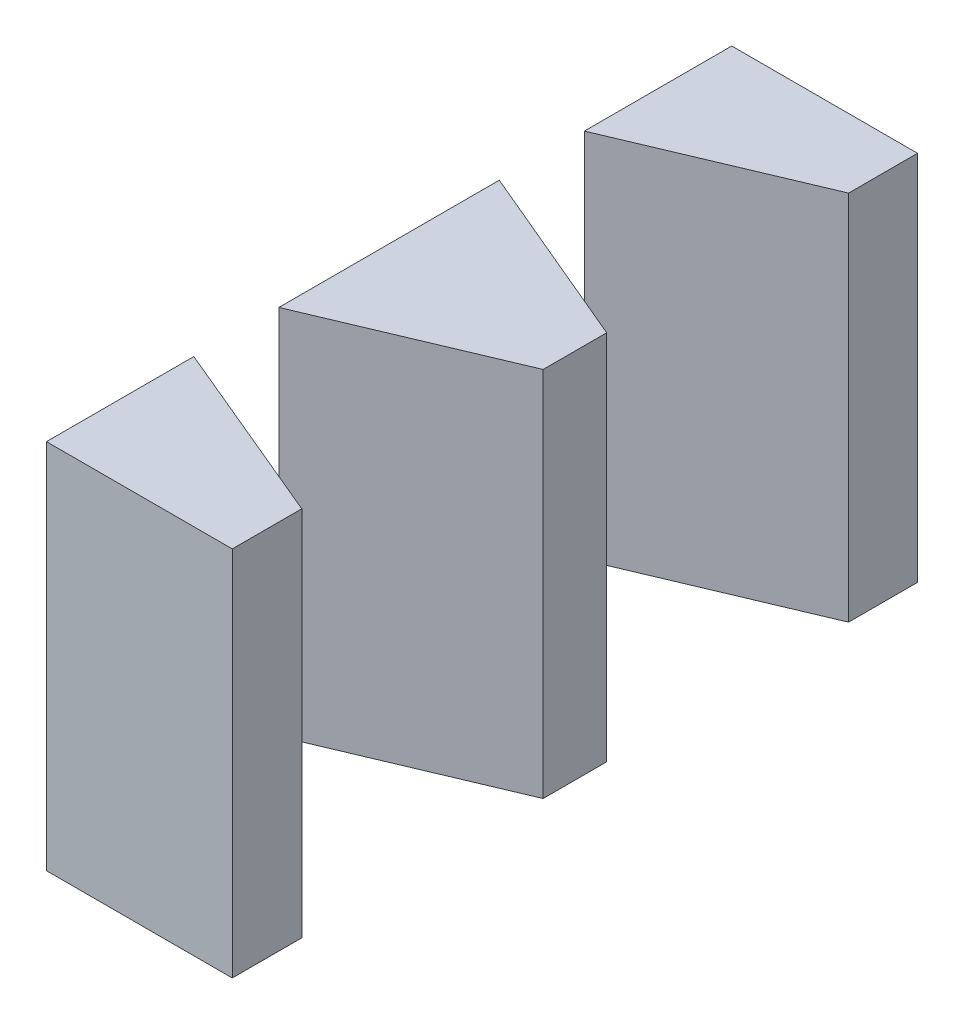
ISO-10303-21;
HEADER;
FILE_DESCRIPTION(('STEP AP214'),'2;1');
FILE_NAME('part.step','',(''),(''),'','','');
FILE_SCHEMA(('AUTOMOTIVE_DESIGN { 1 0 10303 214 1 1 1 1 }'));
ENDSEC;
DATA;
#1=APPLICATION_CONTEXT('core data for automotive mechanical design processes');
#2=APPLICATION_PROTOCOL_DEFINITION('international standard','automotive_design',2000,#1);
#3=PRODUCT_CONTEXT('',#1,'mechanical');
#4=PRODUCT('Part','Part','',(#3));
#5=PRODUCT_RELATED_PRODUCT_CATEGORY('part','',(#4));
#6=PRODUCT_DEFINITION_FORMATION('','',#4);
#7=PRODUCT_DEFINITION_CONTEXT('part definition',#1,'design');
#8=PRODUCT_DEFINITION('design','',#6,#7);
#9=PRODUCT_DEFINITION_SHAPE('','',#8);
#10=(LENGTH_UNIT() NAMED_UNIT(*) SI_UNIT(.MILLI.,.METRE.));
#11=(NAMED_UNIT(*) PLANE_ANGLE_UNIT() SI_UNIT($,.RADIAN.));
#12=(NAMED_UNIT(*) SI_UNIT($,.STERADIAN.) SOLID_ANGLE_UNIT());
#13=UNCERTAINTY_MEASURE_WITH_UNIT(LENGTH_MEASURE(1.E-05),#10,'distance_accuracy_value','');
#14=(GEOMETRIC_REPRESENTATION_CONTEXT(3) GLOBAL_UNCERTAINTY_ASSIGNED_CONTEXT((#13)) GLOBAL_UNIT_ASSIGNED_CONTEXT((#10,
#11,#12)) REPRESENTATION_CONTEXT('',''));
#15=CARTESIAN_POINT('',(0.,0.,0.));
#16=DIRECTION('',(0.,0.,1.));
#17=DIRECTION('',(1.,0.,0.));
#18=AXIS2_PLACEMENT_3D('',#15,#16,#17);
#19=CARTESIAN_POINT('',(0.,25.,0.));
#20=DIRECTION('',(1.,0.,0.));
#21=DIRECTION('',(0.,0.,-1.));
#22=AXIS2_PLACEMENT_3D('',#19,#20,#21);
#23=PLANE('',#22);
#24=DIRECTION('',(0.,-1.,0.));
#25=VECTOR('',#24,1.);
#26=CARTESIAN_POINT('',(0.,25.,-5.94815032326452));
#27=LINE('',#26,#25);
#28=CARTESIAN_POINT('',(0.,25.,-5.94815032326452));
#29=VERTEX_POINT('',#28);
#30=CARTESIAN_POINT('',(0.,10.,-5.94815032326452));
#31=VERTEX_POINT('',#30);
#32=EDGE_CURVE('E134',#29,#31,#27,.T.);
#33=ORIENTED_EDGE('',*,*,#32,.T.);
#34=DIRECTION('',(0.,0.,-1.));
#35=VECTOR('',#34,1.);
#36=CARTESIAN_POINT('',(0.,10.,0.));
#37=LINE('',#36,#35);
#38=CARTESIAN_POINT('',(0.,10.,0.));
#39=VERTEX_POINT('',#38);
#40=EDGE_CURVE('E170',#39,#31,#37,.T.);
#41=ORIENTED_EDGE('',*,*,#40,.F.);
#42=DIRECTION('',(0.,-1.,0.));
#43=VECTOR('',#42,1.);
#44=CARTESIAN_POINT('',(0.,25.,0.));
#45=LINE('',#44,#43);
#46=CARTESIAN_POINT('',(0.,25.,0.));
#47=VERTEX_POINT('',#46);
#48=EDGE_CURVE('E177',#47,#39,#45,.T.);
#49=ORIENTED_EDGE('',*,*,#48,.F.);
#50=DIRECTION('',(0.,0.,1.));
#51=VECTOR('',#50,1.);
#52=CARTESIAN_POINT('',(0.,25.,0.));
#53=LINE('',#52,#51);
#54=EDGE_CURVE('E157',#29,#47,#53,.T.);
#55=ORIENTED_EDGE('',*,*,#54,.F.);
#56=EDGE_LOOP('',(#33,#41,#49,#55));
#57=FACE_BOUND('',#56,.T.);
#58=ADVANCED_FACE('F108',(#57),#23,.F.);
#59=CARTESIAN_POINT('',(7.5,25.,0.));
#60=DIRECTION('',(-1.,0.,0.));
#61=DIRECTION('',(0.,0.,1.));
#62=AXIS2_PLACEMENT_3D('',#59,#60,#61);
#63=PLANE('',#62);
#64=DIRECTION('',(0.,-1.,0.));
#65=VECTOR('',#64,1.);
#66=CARTESIAN_POINT('',(7.5,25.,-2.80535000193112));
#67=LINE('',#66,#65);
#68=CARTESIAN_POINT('',(7.5,25.,-2.80535000193112));
#69=VERTEX_POINT('',#68);
#70=CARTESIAN_POINT('',(7.5,10.,-2.80535000193112));
#71=VERTEX_POINT('',#70);
#72=EDGE_CURVE('E13',#69,#71,#67,.T.);
#73=ORIENTED_EDGE('',*,*,#72,.F.);
#74=DIRECTION('',(0.,0.,-1.));
#75=VECTOR('',#74,1.);
#76=CARTESIAN_POINT('',(7.5,25.,0.));
#77=LINE('',#76,#75);
#78=CARTESIAN_POINT('',(7.5,25.,0.));
#79=VERTEX_POINT('',#78);
#80=EDGE_CURVE('E111',#79,#69,#77,.T.);
#81=ORIENTED_EDGE('',*,*,#80,.F.);
#82=DIRECTION('',(0.,-1.,0.));
#83=VECTOR('',#82,1.);
#84=CARTESIAN_POINT('',(7.5,25.,0.));
#85=LINE('',#84,#83);
#86=CARTESIAN_POINT('',(7.5,10.,0.));
#87=VERTEX_POINT('',#86);
#88=EDGE_CURVE('E163',#79,#87,#85,.T.);
#89=ORIENTED_EDGE('',*,*,#88,.T.);
#90=DIRECTION('',(0.,0.,1.));
#91=VECTOR('',#90,1.);
#92=CARTESIAN_POINT('',(7.5,10.,0.));
#93=LINE('',#92,#91);
#94=EDGE_CURVE('E172',#71,#87,#93,.T.);
#95=ORIENTED_EDGE('',*,*,#94,.F.);
#96=EDGE_LOOP('',(#73,#81,#89,#95));
#97=FACE_BOUND('',#96,.T.);
#98=ADVANCED_FACE('F169',(#97),#63,.F.);
#99=CARTESIAN_POINT('',(0.,25.,0.));
#100=DIRECTION('',(0.,-1.,0.));
#101=DIRECTION('',(0.,0.,-1.));
#102=AXIS2_PLACEMENT_3D('',#99,#100,#101);
#103=PLANE('',#102);
#104=DIRECTION('',(0.922297893226578,0.,0.386479748693014));
#105=VECTOR('',#104,1.);
#106=CARTESIAN_POINT('',(2.12021495879628,25.,-5.05969535609107));
#107=LINE('',#106,#105);
#108=EDGE_CURVE('E117',#29,#69,#107,.T.);
#109=ORIENTED_EDGE('',*,*,#108,.F.);
#110=ORIENTED_EDGE('',*,*,#54,.T.);
#111=DIRECTION('',(1.,0.,0.));
#112=VECTOR('',#111,1.);
#113=CARTESIAN_POINT('',(0.,25.,0.));
#114=LINE('',#113,#112);
#115=EDGE_CURVE('E152',#47,#79,#114,.T.);
#116=ORIENTED_EDGE('',*,*,#115,.T.);
#117=ORIENTED_EDGE('',*,*,#80,.T.);
#118=EDGE_LOOP('',(#109,#110,#116,#117));
#119=FACE_BOUND('',#118,.T.);
#120=ADVANCED_FACE('F154',(#119),#103,.F.);
#121=CARTESIAN_POINT('',(0.,10.,0.));
#122=DIRECTION('',(0.,-1.,0.));
#123=DIRECTION('',(0.,0.,-1.));
#124=AXIS2_PLACEMENT_3D('',#121,#122,#123);
#125=PLANE('',#124);
#126=ORIENTED_EDGE('',*,*,#40,.T.);
#127=DIRECTION('',(0.922297893226578,0.,0.386479748693014));
#128=VECTOR('',#127,1.);
#129=CARTESIAN_POINT('',(2.12021495879628,10.,-5.05969535609107));
#130=LINE('',#129,#128);
#131=EDGE_CURVE('E125',#31,#71,#130,.T.);
#132=ORIENTED_EDGE('',*,*,#131,.T.);
#133=ORIENTED_EDGE('',*,*,#94,.T.);
#134=DIRECTION('',(-1.,0.,0.));
#135=VECTOR('',#134,1.);
#136=CARTESIAN_POINT('',(0.,10.,0.));
#137=LINE('',#136,#135);
#138=EDGE_CURVE('E141',#87,#39,#137,.T.);
#139=ORIENTED_EDGE('',*,*,#138,.T.);
#140=EDGE_LOOP('',(#126,#132,#133,#139));
#141=FACE_BOUND('',#140,.T.);
#142=ADVANCED_FACE('F188',(#141),#125,.T.);
#143=CARTESIAN_POINT('',(0.,25.,0.));
#144=DIRECTION('',(0.,0.,-1.));
#145=DIRECTION('',(-1.,0.,0.));
#146=AXIS2_PLACEMENT_3D('',#143,#144,#145);
#147=PLANE('',#146);
#148=ORIENTED_EDGE('',*,*,#138,.F.);
#149=ORIENTED_EDGE('',*,*,#88,.F.);
#150=ORIENTED_EDGE('',*,*,#115,.F.);
#151=ORIENTED_EDGE('',*,*,#48,.T.);
#152=EDGE_LOOP('',(#148,#149,#150,#151));
#153=FACE_BOUND('',#152,.T.);
#154=ADVANCED_FACE('F164',(#153),#147,.F.);
#155=CARTESIAN_POINT('',(2.12021495879628,25.,-5.05969535609107));
#156=DIRECTION('',(0.386479748693014,0.,-0.922297893226578));
#157=DIRECTION('',(-0.922297893226578,0.,-0.386479748693014));
#158=AXIS2_PLACEMENT_3D('',#155,#156,#157);
#159=PLANE('',#158);
#160=ORIENTED_EDGE('',*,*,#32,.F.);
#161=ORIENTED_EDGE('',*,*,#108,.T.);
#162=ORIENTED_EDGE('',*,*,#72,.T.);
#163=ORIENTED_EDGE('',*,*,#131,.F.);
#164=EDGE_LOOP('',(#160,#161,#162,#163));
#165=FACE_BOUND('',#164,.T.);
#166=ADVANCED_FACE('F193',(#165),#159,.T.);
#167=CLOSED_SHELL('',(#58,#98,#120,#142,#154,#166));
#168=MANIFOLD_SOLID_BREP('B2',#167);
#169=CARTESIAN_POINT('',(0.,10.,0.));
#170=DIRECTION('',(0.,-1.,0.));
#171=DIRECTION('',(0.,0.,-1.));
#172=AXIS2_PLACEMENT_3D('',#169,#170,#171);
#173=PLANE('',#172);
#174=DIRECTION('',(0.,0.,-1.));
#175=VECTOR('',#174,1.);
#176=CARTESIAN_POINT('',(0.,10.,0.));
#177=LINE('',#176,#175);
#178=CARTESIAN_POINT('',(0.,10.,-9.38207915606985));
#179=VERTEX_POINT('',#178);
#180=CARTESIAN_POINT('',(0.,10.,-18.2779208439301));
#181=VERTEX_POINT('',#180);
#182=EDGE_CURVE('E245',#179,#181,#177,.T.);
#183=ORIENTED_EDGE('',*,*,#182,.T.);
#184=DIRECTION('',(0.921322911056656,0.,0.388798268465909));
#185=VECTOR('',#184,1.);
#186=CARTESIAN_POINT('',(6.54731122410501,10.,-15.5149555073578));
#187=LINE('',#186,#185);
#188=CARTESIAN_POINT('',(7.5,10.,-15.1129208439301));
#189=VERTEX_POINT('',#188);
#190=EDGE_CURVE('E260',#181,#189,#187,.T.);
#191=ORIENTED_EDGE('',*,*,#190,.T.);
#192=DIRECTION('',(0.,0.,1.));
#193=VECTOR('',#192,1.);
#194=CARTESIAN_POINT('',(7.5,10.,0.));
#195=LINE('',#194,#193);
#196=CARTESIAN_POINT('',(7.5,10.,-12.5470791560699));
#197=VERTEX_POINT('',#196);
#198=EDGE_CURVE('E298',#189,#197,#195,.T.);
#199=ORIENTED_EDGE('',*,*,#198,.T.);
#200=DIRECTION('',(0.921322911056656,0.,-0.388798268465909));
#201=VECTOR('',#200,1.);
#202=CARTESIAN_POINT('',(-3.36074287050964,10.,-7.96384566471479));
#203=LINE('',#202,#201);
#204=EDGE_CURVE('E284',#179,#197,#203,.T.);
#205=ORIENTED_EDGE('',*,*,#204,.F.);
#206=EDGE_LOOP('',(#183,#191,#199,#205));
#207=FACE_BOUND('',#206,.T.);
#208=ADVANCED_FACE('F241',(#207),#173,.T.);
#209=CARTESIAN_POINT('',(0.,25.,0.));
#210=DIRECTION('',(0.,-1.,0.));
#211=DIRECTION('',(0.,0.,-1.));
#212=AXIS2_PLACEMENT_3D('',#209,#210,#211);
#213=PLANE('',#212);
#214=DIRECTION('',(0.921322911056656,0.,0.388798268465909));
#215=VECTOR('',#214,1.);
#216=CARTESIAN_POINT('',(6.54731122410501,25.,-15.5149555073578));
#217=LINE('',#216,#215);
#218=CARTESIAN_POINT('',(0.,25.,-18.2779208439301));
#219=VERTEX_POINT('',#218);
#220=CARTESIAN_POINT('',(7.5,25.,-15.1129208439301));
#221=VERTEX_POINT('',#220);
#222=EDGE_CURVE('E252',#219,#221,#217,.T.);
#223=ORIENTED_EDGE('',*,*,#222,.F.);
#224=DIRECTION('',(0.,0.,1.));
#225=VECTOR('',#224,1.);
#226=CARTESIAN_POINT('',(0.,25.,0.));
#227=LINE('',#226,#225);
#228=CARTESIAN_POINT('',(0.,25.,-9.38207915606985));
#229=VERTEX_POINT('',#228);
#230=EDGE_CURVE('E305',#219,#229,#227,.T.);
#231=ORIENTED_EDGE('',*,*,#230,.T.);
#232=DIRECTION('',(0.921322911056656,0.,-0.388798268465909));
#233=VECTOR('',#232,1.);
#234=CARTESIAN_POINT('',(-3.36074287050964,25.,-7.96384566471479));
#235=LINE('',#234,#233);
#236=CARTESIAN_POINT('',(7.5,25.,-12.5470791560699));
#237=VERTEX_POINT('',#236);
#238=EDGE_CURVE('E287',#229,#237,#235,.T.);
#239=ORIENTED_EDGE('',*,*,#238,.T.);
#240=DIRECTION('',(0.,0.,-1.));
#241=VECTOR('',#240,1.);
#242=CARTESIAN_POINT('',(7.5,25.,0.));
#243=LINE('',#242,#241);
#244=EDGE_CURVE('E310',#237,#221,#243,.T.);
#245=ORIENTED_EDGE('',*,*,#244,.T.);
#246=EDGE_LOOP('',(#223,#231,#239,#245));
#247=FACE_BOUND('',#246,.T.);
#248=ADVANCED_FACE('F323',(#247),#213,.F.);
#249=CARTESIAN_POINT('',(7.5,25.,0.));
#250=DIRECTION('',(-1.,0.,0.));
#251=DIRECTION('',(0.,0.,1.));
#252=AXIS2_PLACEMENT_3D('',#249,#250,#251);
#253=PLANE('',#252);
#254=DIRECTION('',(0.,-1.,0.));
#255=VECTOR('',#254,1.);
#256=CARTESIAN_POINT('',(7.5,25.,-15.1129208439301));
#257=LINE('',#256,#255);
#258=EDGE_CURVE('E106',#221,#189,#257,.T.);
#259=ORIENTED_EDGE('',*,*,#258,.F.);
#260=ORIENTED_EDGE('',*,*,#244,.F.);
#261=DIRECTION('',(0.,-1.,0.));
#262=VECTOR('',#261,1.);
#263=CARTESIAN_POINT('',(7.5,25.,-12.5470791560699));
#264=LINE('',#263,#262);
#265=EDGE_CURVE('E311',#237,#197,#264,.T.);
#266=ORIENTED_EDGE('',*,*,#265,.T.);
#267=ORIENTED_EDGE('',*,*,#198,.F.);
#268=EDGE_LOOP('',(#259,#260,#266,#267));
#269=FACE_BOUND('',#268,.T.);
#270=ADVANCED_FACE('F326',(#269),#253,.F.);
#271=CARTESIAN_POINT('',(0.,25.,0.));
#272=DIRECTION('',(1.,0.,0.));
#273=DIRECTION('',(0.,0.,-1.));
#274=AXIS2_PLACEMENT_3D('',#271,#272,#273);
#275=PLANE('',#274);
#276=DIRECTION('',(0.,-1.,0.));
#277=VECTOR('',#276,1.);
#278=CARTESIAN_POINT('',(0.,25.,-18.2779208439301));
#279=LINE('',#278,#277);
#280=EDGE_CURVE('E276',#219,#181,#279,.T.);
#281=ORIENTED_EDGE('',*,*,#280,.T.);
#282=ORIENTED_EDGE('',*,*,#182,.F.);
#283=DIRECTION('',(0.,-1.,0.));
#284=VECTOR('',#283,1.);
#285=CARTESIAN_POINT('',(0.,25.,-9.38207915606985));
#286=LINE('',#285,#284);
#287=EDGE_CURVE('E281',#229,#179,#286,.T.);
#288=ORIENTED_EDGE('',*,*,#287,.F.);
#289=ORIENTED_EDGE('',*,*,#230,.F.);
#290=EDGE_LOOP('',(#281,#282,#288,#289));
#291=FACE_BOUND('',#290,.T.);
#292=ADVANCED_FACE('F243',(#291),#275,.F.);
#293=CARTESIAN_POINT('',(-3.36074287050964,25.,-7.96384566471479));
#294=DIRECTION('',(-0.388798268465909,0.,-0.921322911056656));
#295=DIRECTION('',(-0.921322911056656,0.,0.388798268465909));
#296=AXIS2_PLACEMENT_3D('',#293,#294,#295);
#297=PLANE('',#296);
#298=ORIENTED_EDGE('',*,*,#204,.T.);
#299=ORIENTED_EDGE('',*,*,#265,.F.);
#300=ORIENTED_EDGE('',*,*,#238,.F.);
#301=ORIENTED_EDGE('',*,*,#287,.T.);
#302=EDGE_LOOP('',(#298,#299,#300,#301));
#303=FACE_BOUND('',#302,.T.);
#304=ADVANCED_FACE('F283',(#303),#297,.F.);
#305=CARTESIAN_POINT('',(6.54731122410501,25.,-15.5149555073578));
#306=DIRECTION('',(0.388798268465909,0.,-0.921322911056656));
#307=DIRECTION('',(-0.921322911056656,0.,-0.388798268465909));
#308=AXIS2_PLACEMENT_3D('',#305,#306,#307);
#309=PLANE('',#308);
#310=ORIENTED_EDGE('',*,*,#280,.F.);
#311=ORIENTED_EDGE('',*,*,#222,.T.);
#312=ORIENTED_EDGE('',*,*,#258,.T.);
#313=ORIENTED_EDGE('',*,*,#190,.F.);
#314=EDGE_LOOP('',(#310,#311,#312,#313));
#315=FACE_BOUND('',#314,.T.);
#316=ADVANCED_FACE('F327',(#315),#309,.T.);
#317=CLOSED_SHELL('',(#208,#248,#270,#292,#304,#316));
#318=MANIFOLD_SOLID_BREP('B7',#317);
#319=CARTESIAN_POINT('',(0.,25.,-27.66));
#320=DIRECTION('',(0.,0.,1.));
#321=DIRECTION('',(1.,0.,0.));
#322=AXIS2_PLACEMENT_3D('',#319,#320,#321);
#323=PLANE('',#322);
#324=DIRECTION('',(1.,0.,0.));
#325=VECTOR('',#324,1.);
#326=CARTESIAN_POINT('',(0.,10.,-27.66));
#327=LINE('',#326,#325);
#328=CARTESIAN_POINT('',(0.,10.,-27.66));
#329=VERTEX_POINT('',#328);
#330=CARTESIAN_POINT('',(7.5,10.,-27.66));
#331=VERTEX_POINT('',#330);
#332=EDGE_CURVE('E442',#329,#331,#327,.T.);
#333=ORIENTED_EDGE('',*,*,#332,.F.);
#334=DIRECTION('',(0.,-1.,0.));
#335=VECTOR('',#334,1.);
#336=CARTESIAN_POINT('',(0.,25.,-27.66));
#337=LINE('',#336,#335);
#338=CARTESIAN_POINT('',(0.,25.,-27.66));
#339=VERTEX_POINT('',#338);
#340=EDGE_CURVE('E423',#339,#329,#337,.T.);
#341=ORIENTED_EDGE('',*,*,#340,.F.);
#342=DIRECTION('',(-1.,0.,0.));
#343=VECTOR('',#342,1.);
#344=CARTESIAN_POINT('',(0.,25.,-27.66));
#345=LINE('',#344,#343);
#346=CARTESIAN_POINT('',(7.5,25.,-27.66));
#347=VERTEX_POINT('',#346);
#348=EDGE_CURVE('E424',#347,#339,#345,.T.);
#349=ORIENTED_EDGE('',*,*,#348,.F.);
#350=DIRECTION('',(0.,-1.,0.));
#351=VECTOR('',#350,1.);
#352=CARTESIAN_POINT('',(7.5,25.,-27.66));
#353=LINE('',#352,#351);
#354=EDGE_CURVE('E436',#347,#331,#353,.T.);
#355=ORIENTED_EDGE('',*,*,#354,.T.);
#356=EDGE_LOOP('',(#333,#341,#349,#355));
#357=FACE_BOUND('',#356,.T.);
#358=ADVANCED_FACE('F380',(#357),#323,.F.);
#359=CARTESIAN_POINT('',(0.,10.,0.));
#360=DIRECTION('',(0.,-1.,0.));
#361=DIRECTION('',(0.,0.,-1.));
#362=AXIS2_PLACEMENT_3D('',#359,#360,#361);
#363=PLANE('',#362);
#364=DIRECTION('',(0.921322911056656,0.,-0.388798268465909));
#365=VECTOR('',#364,1.);
#366=CARTESIAN_POINT('',(-7.77745678904177,10.,-18.4299923910942));
#367=LINE('',#366,#365);
#368=CARTESIAN_POINT('',(0.,10.,-21.7120791560699));
#369=VERTEX_POINT('',#368);
#370=CARTESIAN_POINT('',(7.5,10.,-24.8770791560699));
#371=VERTEX_POINT('',#370);
#372=EDGE_CURVE('E390',#369,#371,#367,.T.);
#373=ORIENTED_EDGE('',*,*,#372,.F.);
#374=DIRECTION('',(0.,0.,-1.));
#375=VECTOR('',#374,1.);
#376=CARTESIAN_POINT('',(0.,10.,0.));
#377=LINE('',#376,#375);
#378=EDGE_CURVE('E384',#369,#329,#377,.T.);
#379=ORIENTED_EDGE('',*,*,#378,.T.);
#380=ORIENTED_EDGE('',*,*,#332,.T.);
#381=DIRECTION('',(0.,0.,1.));
#382=VECTOR('',#381,1.);
#383=CARTESIAN_POINT('',(7.5,10.,0.));
#384=LINE('',#383,#382);
#385=EDGE_CURVE('E440',#331,#371,#384,.T.);
#386=ORIENTED_EDGE('',*,*,#385,.T.);
#387=EDGE_LOOP('',(#373,#379,#380,#386));
#388=FACE_BOUND('',#387,.T.);
#389=ADVANCED_FACE('F452',(#388),#363,.T.);
#390=CARTESIAN_POINT('',(0.,25.,0.));
#391=DIRECTION('',(0.,-1.,0.));
#392=DIRECTION('',(0.,0.,-1.));
#393=AXIS2_PLACEMENT_3D('',#390,#391,#392);
#394=PLANE('',#393);
#395=DIRECTION('',(0.,0.,1.));
#396=VECTOR('',#395,1.);
#397=CARTESIAN_POINT('',(0.,25.,0.));
#398=LINE('',#397,#396);
#399=CARTESIAN_POINT('',(0.,25.,-21.7120791560699));
#400=VERTEX_POINT('',#399);
#401=EDGE_CURVE('E432',#339,#400,#398,.T.);
#402=ORIENTED_EDGE('',*,*,#401,.T.);
#403=DIRECTION('',(0.921322911056656,0.,-0.388798268465909));
#404=VECTOR('',#403,1.);
#405=CARTESIAN_POINT('',(-7.77745678904177,25.,-18.4299923910942));
#406=LINE('',#405,#404);
#407=CARTESIAN_POINT('',(7.5,25.,-24.8770791560699));
#408=VERTEX_POINT('',#407);
#409=EDGE_CURVE('E418',#400,#408,#406,.T.);
#410=ORIENTED_EDGE('',*,*,#409,.T.);
#411=DIRECTION('',(0.,0.,-1.));
#412=VECTOR('',#411,1.);
#413=CARTESIAN_POINT('',(7.5,25.,0.));
#414=LINE('',#413,#412);
#415=EDGE_CURVE('E429',#408,#347,#414,.T.);
#416=ORIENTED_EDGE('',*,*,#415,.T.);
#417=ORIENTED_EDGE('',*,*,#348,.T.);
#418=EDGE_LOOP('',(#402,#410,#416,#417));
#419=FACE_BOUND('',#418,.T.);
#420=ADVANCED_FACE('F428',(#419),#394,.F.);
#421=CARTESIAN_POINT('',(7.5,25.,0.));
#422=DIRECTION('',(-1.,0.,0.));
#423=DIRECTION('',(0.,0.,1.));
#424=AXIS2_PLACEMENT_3D('',#421,#422,#423);
#425=PLANE('',#424);
#426=ORIENTED_EDGE('',*,*,#415,.F.);
#427=DIRECTION('',(0.,-1.,0.));
#428=VECTOR('',#427,1.);
#429=CARTESIAN_POINT('',(7.5,25.,-24.8770791560699));
#430=LINE('',#429,#428);
#431=EDGE_CURVE('E415',#408,#371,#430,.T.);
#432=ORIENTED_EDGE('',*,*,#431,.T.);
#433=ORIENTED_EDGE('',*,*,#385,.F.);
#434=ORIENTED_EDGE('',*,*,#354,.F.);
#435=EDGE_LOOP('',(#426,#432,#433,#434));
#436=FACE_BOUND('',#435,.T.);
#437=ADVANCED_FACE('F434',(#436),#425,.F.);
#438=CARTESIAN_POINT('',(0.,25.,0.));
#439=DIRECTION('',(1.,0.,0.));
#440=DIRECTION('',(0.,0.,-1.));
#441=AXIS2_PLACEMENT_3D('',#438,#439,#440);
#442=PLANE('',#441);
#443=ORIENTED_EDGE('',*,*,#378,.F.);
#444=DIRECTION('',(0.,-1.,0.));
#445=VECTOR('',#444,1.);
#446=CARTESIAN_POINT('',(0.,25.,-21.7120791560699));
#447=LINE('',#446,#445);
#448=EDGE_CURVE('E239',#400,#369,#447,.T.);
#449=ORIENTED_EDGE('',*,*,#448,.F.);
#450=ORIENTED_EDGE('',*,*,#401,.F.);
#451=ORIENTED_EDGE('',*,*,#340,.T.);
#452=EDGE_LOOP('',(#443,#449,#450,#451));
#453=FACE_BOUND('',#452,.T.);
#454=ADVANCED_FACE('F382',(#453),#442,.F.);
#455=CARTESIAN_POINT('',(-7.77745678904177,25.,-18.4299923910942));
#456=DIRECTION('',(-0.388798268465909,0.,-0.921322911056656));
#457=DIRECTION('',(-0.921322911056656,0.,0.388798268465909));
#458=AXIS2_PLACEMENT_3D('',#455,#456,#457);
#459=PLANE('',#458);
#460=ORIENTED_EDGE('',*,*,#372,.T.);
#461=ORIENTED_EDGE('',*,*,#431,.F.);
#462=ORIENTED_EDGE('',*,*,#409,.F.);
#463=ORIENTED_EDGE('',*,*,#448,.T.);
#464=EDGE_LOOP('',(#460,#461,#462,#463));
#465=FACE_BOUND('',#464,.T.);
#466=ADVANCED_FACE('F417',(#465),#459,.F.);
#467=CLOSED_SHELL('',(#358,#389,#420,#437,#454,#466));
#468=MANIFOLD_SOLID_BREP('B100',#467);
#469=ADVANCED_BREP_SHAPE_REPRESENTATION('',(#18,#168,#318,#468),#14);
#470=SHAPE_DEFINITION_REPRESENTATION(#9,#469);
ENDSEC;
END-ISO-10303-21;
